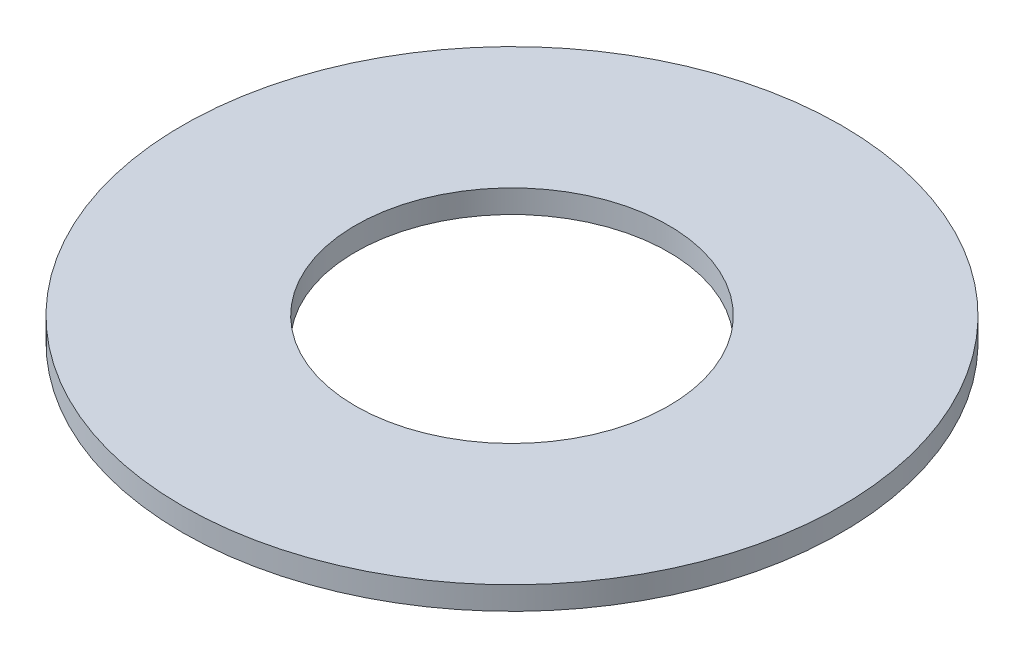
ISO-10303-21;
HEADER;
FILE_DESCRIPTION(('STEP AP214'),'2;1');
FILE_NAME('part.step','',(''),(''),'','','');
FILE_SCHEMA(('AUTOMOTIVE_DESIGN { 1 0 10303 214 1 1 1 1 }'));
ENDSEC;
DATA;
#1=APPLICATION_CONTEXT('core data for automotive mechanical design processes');
#2=APPLICATION_PROTOCOL_DEFINITION('international standard','automotive_design',2000,#1);
#3=PRODUCT_CONTEXT('',#1,'mechanical');
#4=PRODUCT('Part','Part','',(#3));
#5=PRODUCT_RELATED_PRODUCT_CATEGORY('part','',(#4));
#6=PRODUCT_DEFINITION_FORMATION('','',#4);
#7=PRODUCT_DEFINITION_CONTEXT('part definition',#1,'design');
#8=PRODUCT_DEFINITION('design','',#6,#7);
#9=PRODUCT_DEFINITION_SHAPE('','',#8);
#10=(LENGTH_UNIT() NAMED_UNIT(*) SI_UNIT(.MILLI.,.METRE.));
#11=(NAMED_UNIT(*) PLANE_ANGLE_UNIT() SI_UNIT($,.RADIAN.));
#12=(NAMED_UNIT(*) SI_UNIT($,.STERADIAN.) SOLID_ANGLE_UNIT());
#13=UNCERTAINTY_MEASURE_WITH_UNIT(LENGTH_MEASURE(1.E-05),#10,'distance_accuracy_value','');
#14=(GEOMETRIC_REPRESENTATION_CONTEXT(3) GLOBAL_UNCERTAINTY_ASSIGNED_CONTEXT((#13)) GLOBAL_UNIT_ASSIGNED_CONTEXT((#10,
#11,#12)) REPRESENTATION_CONTEXT('',''));
#15=CARTESIAN_POINT('',(0.,0.,0.));
#16=DIRECTION('',(0.,0.,1.));
#17=DIRECTION('',(1.,0.,0.));
#18=AXIS2_PLACEMENT_3D('',#15,#16,#17);
#19=CARTESIAN_POINT('',(0.,7.,0.));
#20=DIRECTION('',(0.,-1.,0.));
#21=DIRECTION('',(0.,0.,-1.));
#22=AXIS2_PLACEMENT_3D('',#19,#20,#21);
#23=CYLINDRICAL_SURFACE('',#22,100.);
#24=CARTESIAN_POINT('',(0.,7.,0.));
#25=DIRECTION('',(0.,1.,0.));
#26=DIRECTION('',(0.,0.,1.));
#27=AXIS2_PLACEMENT_3D('',#24,#25,#26);
#28=CIRCLE('',#27,100.);
#29=CARTESIAN_POINT('',(0.,7.,100.));
#30=VERTEX_POINT('',#29);
#31=EDGE_CURVE('E10',#30,#30,#28,.T.);
#32=ORIENTED_EDGE('',*,*,#31,.F.);
#33=EDGE_LOOP('',(#32));
#34=FACE_BOUND('',#33,.T.);
#35=CARTESIAN_POINT('',(0.,0.,0.));
#36=DIRECTION('',(0.,1.,0.));
#37=DIRECTION('',(0.,0.,1.));
#38=AXIS2_PLACEMENT_3D('',#35,#36,#37);
#39=CIRCLE('',#38,100.);
#40=CARTESIAN_POINT('',(0.,0.,100.));
#41=VERTEX_POINT('',#40);
#42=EDGE_CURVE('E37',#41,#41,#39,.T.);
#43=ORIENTED_EDGE('',*,*,#42,.T.);
#44=EDGE_LOOP('',(#43));
#45=FACE_BOUND('',#44,.T.);
#46=ADVANCED_FACE('F40',(#34,#45),#23,.T.);
#47=CARTESIAN_POINT('',(0.,7.,0.));
#48=DIRECTION('',(0.,1.,0.));
#49=DIRECTION('',(0.,0.,1.));
#50=AXIS2_PLACEMENT_3D('',#47,#48,#49);
#51=PLANE('',#50);
#52=CARTESIAN_POINT('',(0.,7.,0.));
#53=DIRECTION('',(0.,1.,0.));
#54=DIRECTION('',(0.,0.,1.));
#55=AXIS2_PLACEMENT_3D('',#52,#53,#54);
#56=CIRCLE('',#55,47.5);
#57=CARTESIAN_POINT('',(0.,7.,47.5));
#58=VERTEX_POINT('',#57);
#59=EDGE_CURVE('E50',#58,#58,#56,.T.);
#60=ORIENTED_EDGE('',*,*,#59,.F.);
#61=EDGE_LOOP('',(#60));
#62=FACE_BOUND('',#61,.T.);
#63=ORIENTED_EDGE('',*,*,#31,.T.);
#64=EDGE_LOOP('',(#63));
#65=FACE_BOUND('',#64,.T.);
#66=ADVANCED_FACE('F59',(#62,#65),#51,.T.);
#67=CARTESIAN_POINT('',(0.,0.,0.));
#68=DIRECTION('',(0.,1.,0.));
#69=DIRECTION('',(0.,0.,1.));
#70=AXIS2_PLACEMENT_3D('',#67,#68,#69);
#71=PLANE('',#70);
#72=CARTESIAN_POINT('',(0.,0.,0.));
#73=DIRECTION('',(0.,1.,0.));
#74=DIRECTION('',(0.,0.,1.));
#75=AXIS2_PLACEMENT_3D('',#72,#73,#74);
#76=CIRCLE('',#75,47.5);
#77=CARTESIAN_POINT('',(0.,0.,47.5));
#78=VERTEX_POINT('',#77);
#79=EDGE_CURVE('E47',#78,#78,#76,.T.);
#80=ORIENTED_EDGE('',*,*,#79,.T.);
#81=EDGE_LOOP('',(#80));
#82=FACE_BOUND('',#81,.T.);
#83=ORIENTED_EDGE('',*,*,#42,.F.);
#84=EDGE_LOOP('',(#83));
#85=FACE_BOUND('',#84,.T.);
#86=ADVANCED_FACE('F58',(#82,#85),#71,.F.);
#87=CARTESIAN_POINT('',(0.,7.,0.));
#88=DIRECTION('',(0.,-1.,0.));
#89=DIRECTION('',(0.,0.,-1.));
#90=AXIS2_PLACEMENT_3D('',#87,#88,#89);
#91=CYLINDRICAL_SURFACE('',#90,47.5);
#92=ORIENTED_EDGE('',*,*,#59,.T.);
#93=EDGE_LOOP('',(#92));
#94=FACE_BOUND('',#93,.T.);
#95=ORIENTED_EDGE('',*,*,#79,.F.);
#96=EDGE_LOOP('',(#95));
#97=FACE_BOUND('',#96,.T.);
#98=ADVANCED_FACE('F54',(#94,#97),#91,.F.);
#99=CLOSED_SHELL('',(#46,#66,#86,#98));
#100=MANIFOLD_SOLID_BREP('B2',#99);
#101=ADVANCED_BREP_SHAPE_REPRESENTATION('',(#18,#100),#14);
#102=SHAPE_DEFINITION_REPRESENTATION(#9,#101);
ENDSEC;
END-ISO-10303-21;
